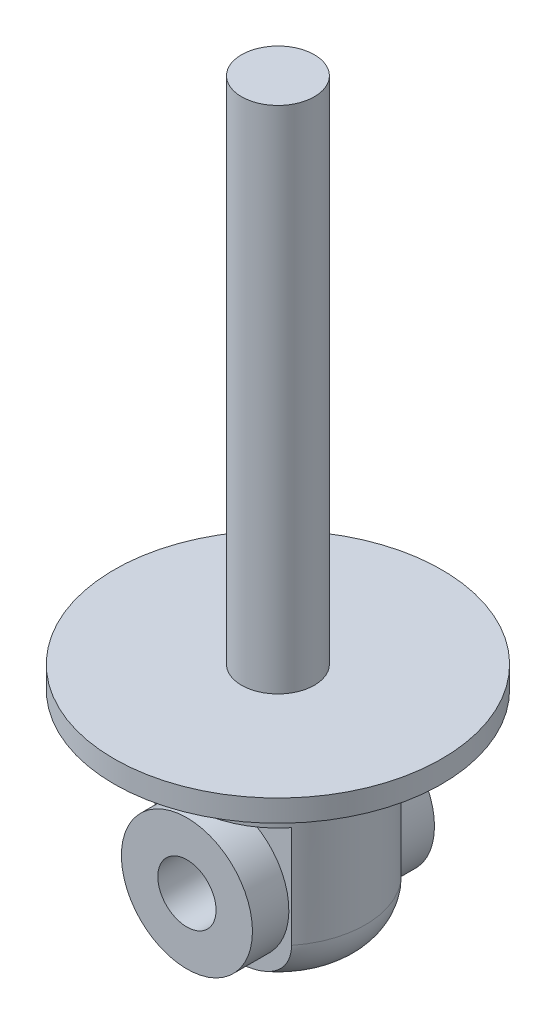
ISO-10303-21;
HEADER;
FILE_DESCRIPTION(('STEP AP214'),'2;1');
FILE_NAME('part.step','',(''),(''),'','','');
FILE_SCHEMA(('AUTOMOTIVE_DESIGN { 1 0 10303 214 1 1 1 1 }'));
ENDSEC;
DATA;
#1=APPLICATION_CONTEXT('core data for automotive mechanical design processes');
#2=APPLICATION_PROTOCOL_DEFINITION('international standard','automotive_design',2000,#1);
#3=PRODUCT_CONTEXT('',#1,'mechanical');
#4=PRODUCT('Part','Part','',(#3));
#5=PRODUCT_RELATED_PRODUCT_CATEGORY('part','',(#4));
#6=PRODUCT_DEFINITION_FORMATION('','',#4);
#7=PRODUCT_DEFINITION_CONTEXT('part definition',#1,'design');
#8=PRODUCT_DEFINITION('design','',#6,#7);
#9=PRODUCT_DEFINITION_SHAPE('','',#8);
#10=(LENGTH_UNIT() NAMED_UNIT(*) SI_UNIT(.MILLI.,.METRE.));
#11=(NAMED_UNIT(*) PLANE_ANGLE_UNIT() SI_UNIT($,.RADIAN.));
#12=(NAMED_UNIT(*) SI_UNIT($,.STERADIAN.) SOLID_ANGLE_UNIT());
#13=UNCERTAINTY_MEASURE_WITH_UNIT(LENGTH_MEASURE(1.E-05),#10,'distance_accuracy_value','');
#14=(GEOMETRIC_REPRESENTATION_CONTEXT(3) GLOBAL_UNCERTAINTY_ASSIGNED_CONTEXT((#13)) GLOBAL_UNIT_ASSIGNED_CONTEXT((#10,
#11,#12)) REPRESENTATION_CONTEXT('',''));
#15=CARTESIAN_POINT('',(0.,0.,0.));
#16=DIRECTION('',(0.,0.,1.));
#17=DIRECTION('',(1.,0.,0.));
#18=AXIS2_PLACEMENT_3D('',#15,#16,#17);
#19=CARTESIAN_POINT('',(-22.5,-8.,7.5));
#20=DIRECTION('',(0.,0.,-1.));
#21=DIRECTION('',(0.,1.,0.));
#22=AXIS2_PLACEMENT_3D('',#19,#20,#21);
#23=PLANE('',#22);
#24=CARTESIAN_POINT('',(0.,-27.8094750193111,7.5));
#25=CARTESIAN_POINT('',(0.184521628242419,-27.8094752958151,7.5));
#26=CARTESIAN_POINT('',(0.369043480287191,-27.8077270322999,7.5));
#27=CARTESIAN_POINT('',(0.737999394292284,-27.8006130628877,7.5));
#28=CARTESIAN_POINT('',(0.922433463434383,-27.7952477367066,7.5));
#29=CARTESIAN_POINT('',(1.29122559425462,-27.780538513706,7.5));
#30=CARTESIAN_POINT('',(1.47558358999919,-27.7711929215574,7.5));
#31=CARTESIAN_POINT('',(1.84401846668315,-27.7479507640883,7.5));
#32=CARTESIAN_POINT('',(2.02809534398339,-27.734054140347,7.5));
#33=CARTESIAN_POINT('',(2.39498843631837,-27.701027325669,7.5));
#34=CARTESIAN_POINT('',(2.57780665418326,-27.6819201299087,7.5));
#35=CARTESIAN_POINT('',(2.94269408038083,-27.6375682217561,7.5));
#36=CARTESIAN_POINT('',(3.12476323156505,-27.6123230495969,7.5));
#37=CARTESIAN_POINT('',(3.6691632505479,-27.5259360262262,7.5));
#38=CARTESIAN_POINT('',(4.02997739530099,-27.4541196223952,7.5));
#39=CARTESIAN_POINT('',(4.57935988961709,-27.315114172541,7.5));
#40=CARTESIAN_POINT('',(4.77122256452969,-27.2608348848703,7.5));
#41=CARTESIAN_POINT('',(5.15109529504942,-27.1402411036094,7.5));
#42=CARTESIAN_POINT('',(5.33910680786539,-27.0739312594077,7.5));
#43=CARTESIAN_POINT('',(5.70992505463463,-26.928148698992,7.5));
#44=CARTESIAN_POINT('',(5.8927332791208,-26.8486797977089,7.5));
#45=CARTESIAN_POINT('',(6.25155879665883,-26.6756224712841,7.5));
#46=CARTESIAN_POINT('',(6.42757723883459,-26.5820364486502,7.5));
#47=CARTESIAN_POINT('',(6.74413785402998,-26.3958384208508,7.5));
#48=CARTESIAN_POINT('',(6.8859302136676,-26.3053527427416,7.5));
#49=CARTESIAN_POINT('',(7.16205254122039,-26.1136422044668,7.5));
#50=CARTESIAN_POINT('',(7.29638393401337,-26.0124194056704,7.5));
#51=CARTESIAN_POINT('',(7.55627452274062,-25.7991822855038,7.5));
#52=CARTESIAN_POINT('',(7.6818315054992,-25.6871652583255,7.5));
#53=CARTESIAN_POINT('',(7.92270374400352,-25.4525813942248,7.5));
#54=CARTESIAN_POINT('',(8.03801892249803,-25.3300144777409,7.5));
#55=CARTESIAN_POINT('',(8.25792234562976,-25.0736714823962,7.5));
#56=CARTESIAN_POINT('',(8.36240569865935,-24.9398051473305,7.5));
#57=CARTESIAN_POINT('',(8.55796576900282,-24.662616920615,7.5));
#58=CARTESIAN_POINT('',(8.64904436046083,-24.5192963548439,7.5));
#59=CARTESIAN_POINT('',(8.81636481076627,-24.2243409104845,7.5));
#60=CARTESIAN_POINT('',(8.89261579636784,-24.0727112205184,7.5));
#61=CARTESIAN_POINT('',(9.02909243430965,-23.7624095052739,7.5));
#62=CARTESIAN_POINT('',(9.08932115899453,-23.6037388369551,7.5));
#63=CARTESIAN_POINT('',(9.1849514334904,-23.3052245459151,7.5));
#64=CARTESIAN_POINT('',(9.22272405795734,-23.1661361294911,7.5));
#65=CARTESIAN_POINT('',(9.28547940350164,-22.8851087613884,7.5));
#66=CARTESIAN_POINT('',(9.31046370365637,-22.7431701638949,7.5));
#67=CARTESIAN_POINT('',(9.34730641699016,-22.4576599589478,7.5));
#68=CARTESIAN_POINT('',(9.35917031033292,-22.3140890586128,7.5));
#69=CARTESIAN_POINT('',(9.36963164548865,-22.0264648581988,7.5));
#70=CARTESIAN_POINT('',(9.36822954903948,-21.8824115750842,7.5));
#71=CARTESIAN_POINT('',(9.35280339576898,-21.6061914815275,7.5));
#72=CARTESIAN_POINT('',(9.33976569953801,-21.4739684759153,7.5));
#73=CARTESIAN_POINT('',(9.30256363878721,-21.2110534946456,7.5));
#74=CARTESIAN_POINT('',(9.27839574533066,-21.0803620180608,7.5));
#75=CARTESIAN_POINT('',(9.21922065645586,-20.8215410609612,7.5));
#76=CARTESIAN_POINT('',(9.18421981495561,-20.6934101253726,7.5));
#77=CARTESIAN_POINT('',(9.1037455253616,-20.4404340442512,7.5));
#78=CARTESIAN_POINT('',(9.05826815366643,-20.3155901493276,7.5));
#79=CARTESIAN_POINT('',(8.95699564520569,-20.0692031015505,7.5));
#80=CARTESIAN_POINT('',(8.90113499399755,-19.9476868658852,7.5));
#81=CARTESIAN_POINT('',(8.77987692751896,-19.7094920695403,7.5));
#82=CARTESIAN_POINT('',(8.71447610526943,-19.5928152563103,7.5));
#83=CARTESIAN_POINT('',(8.50489875856371,-19.2509911073174,7.5));
#84=CARTESIAN_POINT('',(8.34729299116934,-19.0339195251877,7.5));
#85=CARTESIAN_POINT('',(7.98870608163152,-18.609337427954,7.5));
#86=CARTESIAN_POINT('',(7.78529755950601,-18.4039002281567,7.5));
#87=CARTESIAN_POINT('',(7.35109040646742,-18.0246758733926,7.5));
#88=CARTESIAN_POINT('',(7.12029612399674,-17.8508837047537,7.5));
#89=CARTESIAN_POINT('',(6.69864287979115,-17.5744409595824,7.5));
#90=CARTESIAN_POINT('',(6.51223410047273,-17.4648689537028,7.5));
#91=CARTESIAN_POINT('',(6.13034538679086,-17.2626904112622,7.5));
#92=CARTESIAN_POINT('',(5.93486117014358,-17.1700919878543,7.5));
#93=CARTESIAN_POINT('',(5.53658641063457,-17.0006313082269,7.5));
#94=CARTESIAN_POINT('',(5.3337765932138,-16.9238147555949,7.5));
#95=CARTESIAN_POINT('',(4.92331428460809,-16.784875362625,7.5));
#96=CARTESIAN_POINT('',(4.71566315546474,-16.7227484430634,7.5));
#97=CARTESIAN_POINT('',(4.02250667384635,-16.5386673542946,7.5));
#98=CARTESIAN_POINT('',(3.52942656369881,-16.4449803111871,7.5));
#99=CARTESIAN_POINT('',(2.78498720051466,-16.3412352530644,7.5));
#100=CARTESIAN_POINT('',(2.53568557770049,-16.3127705467372,7.5));
#101=CARTESIAN_POINT('',(2.03612434937438,-16.2658269581612,7.5));
#102=CARTESIAN_POINT('',(1.78586486368141,-16.2473468655648,7.5));
#103=CARTESIAN_POINT('',(1.28363112408652,-16.2184283009414,7.5));
#104=CARTESIAN_POINT('',(1.03165466176091,-16.208031590786,7.5));
#105=CARTESIAN_POINT('',(0.527501194688676,-16.1941849220444,7.5));
#106=CARTESIAN_POINT('',(0.275324180848907,-16.1907352988047,7.5));
#107=CARTESIAN_POINT('',(-0.22873134560298,-16.1903333462322,7.5));
#108=CARTESIAN_POINT('',(-0.480609853630178,-16.193373232494,7.5));
#109=CARTESIAN_POINT('',(-0.984173581494272,-16.2063332691715,7.5));
#110=CARTESIAN_POINT('',(-1.23585881660875,-16.2162528039696,7.5));
#111=CARTESIAN_POINT('',(-1.76278825668934,-16.2454935008677,7.5));
#112=CARTESIAN_POINT('',(-2.03798990109172,-16.2656211327378,7.5));
#113=CARTESIAN_POINT('',(-2.58731345976839,-16.3180418431017,7.5));
#114=CARTESIAN_POINT('',(-2.86143522597444,-16.3503365349836,7.5));
#115=CARTESIAN_POINT('',(-3.40623279358437,-16.4300545548583,7.5));
#116=CARTESIAN_POINT('',(-3.67691867401874,-16.4774071358833,7.5));
#117=CARTESIAN_POINT('',(-4.21439476079952,-16.5907053400646,7.5));
#118=CARTESIAN_POINT('',(-4.4811862031647,-16.6566449229111,7.5));
#119=CARTESIAN_POINT('',(-4.94217748017443,-16.7911834026755,7.5));
#120=CARTESIAN_POINT('',(-5.13778160857807,-16.8549558474619,7.5));
#121=CARTESIAN_POINT('',(-5.5239942274174,-16.9961265709521,7.5));
#122=CARTESIAN_POINT('',(-5.71460418712137,-17.0735207892669,7.5));
#123=CARTESIAN_POINT('',(-6.0892198722189,-17.2430793617625,7.5));
#124=CARTESIAN_POINT('',(-6.27322442084439,-17.3352463319138,7.5));
#125=CARTESIAN_POINT('',(-6.63256976145458,-17.5351759469553,7.5));
#126=CARTESIAN_POINT('',(-6.80791280693598,-17.6429345063483,7.5));
#127=CARTESIAN_POINT('',(-7.10989658300675,-17.8487615005737,7.5));
#128=CARTESIAN_POINT('',(-7.2387010399764,-17.9436617626469,7.5));
#129=CARTESIAN_POINT('',(-7.4885662206622,-18.143229826346,7.5));
#130=CARTESIAN_POINT('',(-7.60962602152206,-18.2478987883735,7.5));
#131=CARTESIAN_POINT('',(-7.84271387792475,-18.4668045949393,7.5));
#132=CARTESIAN_POINT('',(-7.95474473789613,-18.5810384459287,7.5));
#133=CARTESIAN_POINT('',(-8.16854933672495,-18.8187268203134,7.5));
#134=CARTESIAN_POINT('',(-8.27032449994957,-18.9421800591116,7.5));
#135=CARTESIAN_POINT('',(-8.46313596223061,-19.1987356397018,7.5));
#136=CARTESIAN_POINT('',(-8.55408255407203,-19.3319055781875,7.5));
#137=CARTESIAN_POINT('',(-8.72304401015934,-19.6061418402457,7.5));
#138=CARTESIAN_POINT('',(-8.80106500403696,-19.747204378254,7.5));
#139=CARTESIAN_POINT('',(-8.94309470867639,-20.0362068877473,7.5));
#140=CARTESIAN_POINT('',(-9.00710515749598,-20.1841460034049,7.5));
#141=CARTESIAN_POINT('',(-9.12014361193693,-20.4856380297523,7.5));
#142=CARTESIAN_POINT('',(-9.16917373274799,-20.6391901444676,7.5));
#143=CARTESIAN_POINT('',(-9.24643392787081,-20.9313639562727,7.5));
#144=CARTESIAN_POINT('',(-9.2764768563288,-21.0695088202567,7.5));
#145=CARTESIAN_POINT('',(-9.32406143536891,-21.3479315795214,7.5));
#146=CARTESIAN_POINT('',(-9.34160421520928,-21.4882092809527,7.5));
#147=CARTESIAN_POINT('',(-9.36396002322679,-21.769719609589,7.5));
#148=CARTESIAN_POINT('',(-9.36877802253041,-21.9109518422674,7.5));
#149=CARTESIAN_POINT('',(-9.36563613906261,-22.1932734390957,7.5));
#150=CARTESIAN_POINT('',(-9.35767657732182,-22.3343628067459,7.5));
#151=CARTESIAN_POINT('',(-9.32998563551062,-22.6064011749062,7.5));
#152=CARTESIAN_POINT('',(-9.31102660205279,-22.7374295539783,7.5));
#153=CARTESIAN_POINT('',(-9.26218788836622,-22.9974780227225,7.5));
#154=CARTESIAN_POINT('',(-9.23230470755187,-23.1264974548056,7.5));
#155=CARTESIAN_POINT('',(-9.16196479385525,-23.3815508516768,7.5));
#156=CARTESIAN_POINT('',(-9.12151307666088,-23.5075862018084,7.5));
#157=CARTESIAN_POINT('',(-9.03044888037393,-23.7559772755244,7.5));
#158=CARTESIAN_POINT('',(-8.97983258590813,-23.8783315975104,7.5));
#159=CARTESIAN_POINT('',(-8.86806175742509,-24.1205569584555,7.5));
#160=CARTESIAN_POINT('',(-8.8067487702029,-24.2403549182388,7.5));
#161=CARTESIAN_POINT('',(-8.67480187441993,-24.4747211723639,7.5));
#162=CARTESIAN_POINT('',(-8.60416462323316,-24.5892875713423,7.5));
#163=CARTESIAN_POINT('',(-8.37928997825773,-24.9242270275788,7.5));
#164=CARTESIAN_POINT('',(-8.21201407264851,-25.1360021075501,7.5));
#165=CARTESIAN_POINT('',(-7.83294273917799,-25.5504485361803,7.5));
#166=CARTESIAN_POINT('',(-7.61853228584699,-25.7507010772538,7.5));
#167=CARTESIAN_POINT('',(-7.16337882817297,-26.1185076671662,7.5));
#168=CARTESIAN_POINT('',(-6.92262753032978,-26.2860513710234,7.5));
#169=CARTESIAN_POINT('',(-6.47886643959529,-26.5545024709803,7.5));
#170=CARTESIAN_POINT('',(-6.27970729507799,-26.6619013252763,7.5));
#171=CARTESIAN_POINT('',(-5.87254463104012,-26.858559219587,7.5));
#172=CARTESIAN_POINT('',(-5.66453691936399,-26.9478095430478,7.5));
#173=CARTESIAN_POINT('',(-5.24180758530231,-27.1096214973705,7.5));
#174=CARTESIAN_POINT('',(-5.0270755390133,-27.1821555960046,7.5));
#175=CARTESIAN_POINT('',(-4.59305326757354,-27.3121001369762,7.5));
#176=CARTESIAN_POINT('',(-4.37376133898654,-27.3695048137837,7.5));
#177=CARTESIAN_POINT('',(-3.81417726059935,-27.4981886749365,7.5));
#178=CARTESIAN_POINT('',(-3.47183296905168,-27.5604951716191,7.5));
#179=CARTESIAN_POINT('',(-2.78359200614868,-27.6609019684328,7.5));
#180=CARTESIAN_POINT('',(-2.43769315620304,-27.6989863972919,7.5));
#181=CARTESIAN_POINT('',(-1.91723181279186,-27.7425563308733,7.5));
#182=CARTESIAN_POINT('',(-1.74318957751325,-27.7548291128016,7.5));
#183=CARTESIAN_POINT('',(-1.39487161182966,-27.7753986995787,7.5));
#184=CARTESIAN_POINT('',(-1.22059588725637,-27.7836956019396,7.5));
#185=CARTESIAN_POINT('',(-0.871965392986033,-27.796777523185,7.5));
#186=CARTESIAN_POINT('',(-0.697610658492165,-27.8015635129394,7.5));
#187=CARTESIAN_POINT('',(-0.34883735064389,-27.8079121855994,7.5));
#188=CARTESIAN_POINT('',(-0.174418775305037,-27.8094747579462,7.5));
#189=CARTESIAN_POINT('',(0.,-27.8094750193111,7.5));
#190=B_SPLINE_CURVE_WITH_KNOTS('',3,(#24,#25,#26,#27,#28,#29,#30,#31,#32,#33,#34,#35,#36,#37,
#38,#39,#40,#41,#42,#43,#44,#45,#46,#47,#48,#49,#50,#51,#52,#53,#54,#55,#56,#57,#58,#59,#60,#61,
#62,#63,#64,#65,#66,#67,#68,#69,#70,#71,#72,#73,#74,#75,#76,#77,#78,#79,#80,#81,#82,#83,#84,#85,
#86,#87,#88,#89,#90,#91,#92,#93,#94,#95,#96,#97,#98,#99,#100,#101,#102,#103,#104,#105,#106,#107,
#108,#109,#110,#111,#112,#113,#114,#115,#116,#117,#118,#119,#120,#121,#122,#123,#124,#125,#126,
#127,#128,#129,#130,#131,#132,#133,#134,#135,#136,#137,#138,#139,#140,#141,#142,#143,#144,#145,
#146,#147,#148,#149,#150,#151,#152,#153,#154,#155,#156,#157,#158,#159,#160,#161,#162,#163,#164,
#165,#166,#167,#168,#169,#170,#171,#172,#173,#174,#175,#176,#177,#178,#179,#180,#181,#182,#183,
#184,#185,#186,#187,#188,#189),.UNSPECIFIED.,.T.,.F.,(4,2,2,2,2,2,2,2,2,2,2,2,2,2,2,2,2,2,2,2,2,
2,2,2,2,2,2,2,2,2,2,2,2,2,2,2,2,2,2,2,2,2,2,2,2,2,2,2,2,2,2,2,2,2,2,2,2,2,2,2,2,2,2,2,2,2,2,2,2,
2,2,2,2,2,2,2,2,2,2,2,2,2,4),(0.,0.553556541747908,1.10705498067111,1.6607894093517,
2.21453094651203,2.76586720349669,3.31724477121585,4.41912680182766,5.01698525599297,
5.61461314908642,6.21206808675634,6.80942146164093,7.31357153503217,7.81762499361292,
8.32180513447662,8.82598907791494,9.33467160980089,9.84328295415677,10.3515802378956,
10.8597799828438,11.291588037567,11.7233427606026,12.1549170790764,12.5864763761707,
12.9845986570771,13.3828472534997,13.7808627038906,14.1790274594522,14.5797954507881,
14.9807069160888,15.7821103743006,16.6461503316802,17.5100532757815,18.1578732554314,
18.8060020817716,19.4559821948789,20.1057815998326,21.6069748462106,22.3596793389022,
23.1122925673176,23.8687687149109,24.6252813779039,25.3808870860739,26.1364251884592,
26.9640249034878,27.7917343993232,28.6156111127982,29.4392203950451,30.0559954213971,
30.6725869093733,31.2892877047367,31.9058271963483,32.3853559200308,32.86494167852,
33.3443778968313,33.823747436381,34.3068464150843,34.7897156366604,35.2725249226045,
35.7552660053908,36.1788379642465,36.6023716529343,37.0257398573389,37.4490974249689,
37.8458122806135,38.2426543730445,38.639308470493,39.0361117351623,39.4393886143668,
39.8428104576492,40.6491243408277,41.5260051520068,42.403162850804,43.08105511347,
43.7592721958253,44.4385984678268,45.1181832448309,46.1608437011148,47.2041866484774,
47.7275747628343,48.2509500399341,48.7741805338586,49.2974289735857),.UNSPECIFIED.);
#191=CARTESIAN_POINT('',(-9.3674969975976,-22.,7.5));
#192=VERTEX_POINT('',#191);
#193=CARTESIAN_POINT('',(9.36749699759766,-21.9999999999999,7.5));
#194=VERTEX_POINT('',#193);
#195=EDGE_CURVE('E146',#192,#194,#190,.T.);
#196=ORIENTED_EDGE('',*,*,#195,.T.);
#197=DIRECTION('',(0.,1.,0.));
#198=VECTOR('',#197,1.);
#199=CARTESIAN_POINT('',(9.3674969975976,-28.,7.49999999999999));
#200=LINE('',#199,#198);
#201=CARTESIAN_POINT('',(9.36749699759759,-8.,7.5));
#202=VERTEX_POINT('',#201);
#203=EDGE_CURVE('E97',#202,#194,#200,.F.);
#204=ORIENTED_EDGE('',*,*,#203,.F.);
#205=DIRECTION('',(1.,0.,0.));
#206=VECTOR('',#205,1.);
#207=CARTESIAN_POINT('',(-22.5,-8.,7.5));
#208=LINE('',#207,#206);
#209=CARTESIAN_POINT('',(-9.36749699759761,-8.,7.5));
#210=VERTEX_POINT('',#209);
#211=EDGE_CURVE('E89',#210,#202,#208,.T.);
#212=ORIENTED_EDGE('',*,*,#211,.F.);
#213=DIRECTION('',(0.,1.,0.));
#214=VECTOR('',#213,1.);
#215=CARTESIAN_POINT('',(-9.3674969975976,-28.,7.49999999999999));
#216=LINE('',#215,#214);
#217=EDGE_CURVE('E67',#192,#210,#216,.T.);
#218=ORIENTED_EDGE('',*,*,#217,.F.);
#219=EDGE_LOOP('',(#196,#204,#212,#218));
#220=FACE_BOUND('',#219,.T.);
#221=CARTESIAN_POINT('',(0.,-18.,7.5));
#222=DIRECTION('',(0.,0.,-1.));
#223=DIRECTION('',(0.,1.,0.));
#224=AXIS2_PLACEMENT_3D('',#221,#222,#223);
#225=CIRCLE('',#224,9.);
#226=CARTESIAN_POINT('',(0.,-9.,7.5));
#227=VERTEX_POINT('',#226);
#228=EDGE_CURVE('E11',#227,#227,#225,.F.);
#229=ORIENTED_EDGE('',*,*,#228,.F.);
#230=EDGE_LOOP('',(#229));
#231=FACE_BOUND('',#230,.T.);
#232=ADVANCED_FACE('F41',(#220,#231),#23,.F.);
#233=CARTESIAN_POINT('',(-22.5,-8.,-7.5));
#234=DIRECTION('',(0.,0.,1.));
#235=DIRECTION('',(0.,-1.,0.));
#236=AXIS2_PLACEMENT_3D('',#233,#234,#235);
#237=PLANE('',#236);
#238=CARTESIAN_POINT('',(0.,-27.8094750193111,-7.5));
#239=CARTESIAN_POINT('',(-0.18452162824242,-27.8094752958151,-7.5));
#240=CARTESIAN_POINT('',(-0.369043480287192,-27.8077270322999,-7.5));
#241=CARTESIAN_POINT('',(-0.737999394292285,-27.8006130628877,-7.5));
#242=CARTESIAN_POINT('',(-0.922433463434385,-27.7952477367066,-7.5));
#243=CARTESIAN_POINT('',(-1.29122559425462,-27.780538513706,-7.5));
#244=CARTESIAN_POINT('',(-1.47558358999919,-27.7711929215574,-7.5));
#245=CARTESIAN_POINT('',(-1.84401846668315,-27.7479507640883,-7.5));
#246=CARTESIAN_POINT('',(-2.02809534398339,-27.734054140347,-7.5));
#247=CARTESIAN_POINT('',(-2.39498843631837,-27.701027325669,-7.5));
#248=CARTESIAN_POINT('',(-2.57780665418326,-27.6819201299087,-7.5));
#249=CARTESIAN_POINT('',(-2.94269408038083,-27.6375682217561,-7.5));
#250=CARTESIAN_POINT('',(-3.12476323156505,-27.6123230495969,-7.5));
#251=CARTESIAN_POINT('',(-3.6691632505479,-27.5259360262262,-7.5));
#252=CARTESIAN_POINT('',(-4.02997739530099,-27.4541196223952,-7.5));
#253=CARTESIAN_POINT('',(-4.57935988961709,-27.315114172541,-7.5));
#254=CARTESIAN_POINT('',(-4.77122256452969,-27.2608348848703,-7.5));
#255=CARTESIAN_POINT('',(-5.15109529504943,-27.1402411036094,-7.5));
#256=CARTESIAN_POINT('',(-5.33910680786539,-27.0739312594077,-7.5));
#257=CARTESIAN_POINT('',(-5.70992505463463,-26.9281486989919,-7.5));
#258=CARTESIAN_POINT('',(-5.8927332791208,-26.8486797977089,-7.5));
#259=CARTESIAN_POINT('',(-6.25155879665883,-26.6756224712841,-7.5));
#260=CARTESIAN_POINT('',(-6.42757723883459,-26.5820364486501,-7.5));
#261=CARTESIAN_POINT('',(-6.74413785402998,-26.3958384208508,-7.5));
#262=CARTESIAN_POINT('',(-6.8859302136676,-26.3053527427416,-7.5));
#263=CARTESIAN_POINT('',(-7.16205254122039,-26.1136422044668,-7.5));
#264=CARTESIAN_POINT('',(-7.29638393401337,-26.0124194056704,-7.5));
#265=CARTESIAN_POINT('',(-7.55627452274062,-25.7991822855038,-7.5));
#266=CARTESIAN_POINT('',(-7.6818315054992,-25.6871652583255,-7.5));
#267=CARTESIAN_POINT('',(-7.92270374400352,-25.4525813942248,-7.5));
#268=CARTESIAN_POINT('',(-8.03801892249803,-25.3300144777409,-7.5));
#269=CARTESIAN_POINT('',(-8.25792234562975,-25.0736714823962,-7.5));
#270=CARTESIAN_POINT('',(-8.36240569865935,-24.9398051473305,-7.5));
#271=CARTESIAN_POINT('',(-8.55796576900282,-24.662616920615,-7.5));
#272=CARTESIAN_POINT('',(-8.64904436046083,-24.5192963548439,-7.5));
#273=CARTESIAN_POINT('',(-8.81636481076626,-24.2243409104845,-7.5));
#274=CARTESIAN_POINT('',(-8.89261579636783,-24.0727112205184,-7.5));
#275=CARTESIAN_POINT('',(-9.02909243430965,-23.7624095052739,-7.5));
#276=CARTESIAN_POINT('',(-9.08932115899453,-23.6037388369551,-7.5));
#277=CARTESIAN_POINT('',(-9.1849514334904,-23.3052245459151,-7.5));
#278=CARTESIAN_POINT('',(-9.22272405795733,-23.166136129491,-7.5));
#279=CARTESIAN_POINT('',(-9.28547940350163,-22.8851087613884,-7.5));
#280=CARTESIAN_POINT('',(-9.31046370365637,-22.7431701638949,-7.5));
#281=CARTESIAN_POINT('',(-9.34730641699015,-22.4576599589478,-7.5));
#282=CARTESIAN_POINT('',(-9.35917031033292,-22.3140890586128,-7.5));
#283=CARTESIAN_POINT('',(-9.36963164548865,-22.0264648581988,-7.5));
#284=CARTESIAN_POINT('',(-9.36822954903947,-21.8824115750842,-7.5));
#285=CARTESIAN_POINT('',(-9.35280339576898,-21.6061914815275,-7.5));
#286=CARTESIAN_POINT('',(-9.33976569953801,-21.4739684759153,-7.5));
#287=CARTESIAN_POINT('',(-9.3025636387872,-21.2110534946456,-7.5));
#288=CARTESIAN_POINT('',(-9.27839574533065,-21.0803620180608,-7.5));
#289=CARTESIAN_POINT('',(-9.21922065645586,-20.8215410609612,-7.5));
#290=CARTESIAN_POINT('',(-9.1842198149556,-20.6934101253726,-7.5));
#291=CARTESIAN_POINT('',(-9.1037455253616,-20.4404340442512,-7.5));
#292=CARTESIAN_POINT('',(-9.05826815366643,-20.3155901493276,-7.5));
#293=CARTESIAN_POINT('',(-8.95699564520569,-20.0692031015505,-7.5));
#294=CARTESIAN_POINT('',(-8.90113499399755,-19.9476868658852,-7.5));
#295=CARTESIAN_POINT('',(-8.77987692751896,-19.7094920695403,-7.5));
#296=CARTESIAN_POINT('',(-8.71447610526942,-19.5928152563103,-7.5));
#297=CARTESIAN_POINT('',(-8.50489875856371,-19.2509911073174,-7.5));
#298=CARTESIAN_POINT('',(-8.34729299116934,-19.0339195251877,-7.5));
#299=CARTESIAN_POINT('',(-7.98870608163152,-18.609337427954,-7.5));
#300=CARTESIAN_POINT('',(-7.78529755950601,-18.4039002281567,-7.5));
#301=CARTESIAN_POINT('',(-7.35109040646742,-18.0246758733926,-7.5));
#302=CARTESIAN_POINT('',(-7.12029612399674,-17.8508837047537,-7.5));
#303=CARTESIAN_POINT('',(-6.69864287979115,-17.5744409595824,-7.5));
#304=CARTESIAN_POINT('',(-6.51223410047273,-17.4648689537028,-7.5));
#305=CARTESIAN_POINT('',(-6.13034538679086,-17.2626904112623,-7.5));
#306=CARTESIAN_POINT('',(-5.93486117014358,-17.1700919878543,-7.5));
#307=CARTESIAN_POINT('',(-5.53658641063457,-17.0006313082269,-7.5));
#308=CARTESIAN_POINT('',(-5.3337765932138,-16.9238147555949,-7.5));
#309=CARTESIAN_POINT('',(-4.9233142846081,-16.784875362625,-7.5));
#310=CARTESIAN_POINT('',(-4.71566315546474,-16.7227484430634,-7.5));
#311=CARTESIAN_POINT('',(-4.02250667384635,-16.5386673542946,-7.5));
#312=CARTESIAN_POINT('',(-3.52942656369881,-16.4449803111871,-7.5));
#313=CARTESIAN_POINT('',(-2.78498720051466,-16.3412352530644,-7.5));
#314=CARTESIAN_POINT('',(-2.53568557770049,-16.3127705467372,-7.5));
#315=CARTESIAN_POINT('',(-2.03612434937438,-16.2658269581612,-7.5));
#316=CARTESIAN_POINT('',(-1.78586486368141,-16.2473468655649,-7.5));
#317=CARTESIAN_POINT('',(-1.28363112408652,-16.2184283009414,-7.5));
#318=CARTESIAN_POINT('',(-1.03165466176091,-16.208031590786,-7.5));
#319=CARTESIAN_POINT('',(-0.527501194688677,-16.1941849220444,-7.5));
#320=CARTESIAN_POINT('',(-0.275324180848908,-16.1907352988047,-7.5));
#321=CARTESIAN_POINT('',(0.22873134560298,-16.1903333462322,-7.5));
#322=CARTESIAN_POINT('',(0.480609853630179,-16.193373232494,-7.5));
#323=CARTESIAN_POINT('',(0.984173581494273,-16.2063332691715,-7.5));
#324=CARTESIAN_POINT('',(1.23585881660875,-16.2162528039696,-7.5));
#325=CARTESIAN_POINT('',(1.76278825668934,-16.2454935008677,-7.5));
#326=CARTESIAN_POINT('',(2.03798990109172,-16.2656211327378,-7.5));
#327=CARTESIAN_POINT('',(2.58731345976839,-16.3180418431018,-7.5));
#328=CARTESIAN_POINT('',(2.86143522597444,-16.3503365349836,-7.5));
#329=CARTESIAN_POINT('',(3.40623279358437,-16.4300545548583,-7.5));
#330=CARTESIAN_POINT('',(3.67691867401874,-16.4774071358833,-7.5));
#331=CARTESIAN_POINT('',(4.21439476079952,-16.5907053400646,-7.5));
#332=CARTESIAN_POINT('',(4.4811862031647,-16.6566449229111,-7.5));
#333=CARTESIAN_POINT('',(4.94217748017443,-16.7911834026755,-7.5));
#334=CARTESIAN_POINT('',(5.13778160857807,-16.8549558474619,-7.5));
#335=CARTESIAN_POINT('',(5.5239942274174,-16.9961265709521,-7.5));
#336=CARTESIAN_POINT('',(5.71460418712137,-17.073520789267,-7.5));
#337=CARTESIAN_POINT('',(6.0892198722189,-17.2430793617625,-7.5));
#338=CARTESIAN_POINT('',(6.27322442084439,-17.3352463319138,-7.5));
#339=CARTESIAN_POINT('',(6.63256976145458,-17.5351759469553,-7.5));
#340=CARTESIAN_POINT('',(6.80791280693598,-17.6429345063483,-7.5));
#341=CARTESIAN_POINT('',(7.10989658300674,-17.8487615005737,-7.5));
#342=CARTESIAN_POINT('',(7.2387010399764,-17.9436617626469,-7.5));
#343=CARTESIAN_POINT('',(7.48856622066219,-18.143229826346,-7.5));
#344=CARTESIAN_POINT('',(7.60962602152205,-18.2478987883735,-7.5));
#345=CARTESIAN_POINT('',(7.84271387792474,-18.4668045949393,-7.5));
#346=CARTESIAN_POINT('',(7.95474473789612,-18.5810384459287,-7.5));
#347=CARTESIAN_POINT('',(8.16854933672494,-18.8187268203134,-7.5));
#348=CARTESIAN_POINT('',(8.27032449994957,-18.9421800591116,-7.5));
#349=CARTESIAN_POINT('',(8.46313596223061,-19.1987356397018,-7.5));
#350=CARTESIAN_POINT('',(8.55408255407203,-19.3319055781875,-7.5));
#351=CARTESIAN_POINT('',(8.72304401015934,-19.6061418402457,-7.5));
#352=CARTESIAN_POINT('',(8.80106500403696,-19.747204378254,-7.5));
#353=CARTESIAN_POINT('',(8.94309470867639,-20.0362068877473,-7.5));
#354=CARTESIAN_POINT('',(9.00710515749598,-20.1841460034049,-7.5));
#355=CARTESIAN_POINT('',(9.12014361193693,-20.4856380297523,-7.5));
#356=CARTESIAN_POINT('',(9.16917373274798,-20.6391901444676,-7.5));
#357=CARTESIAN_POINT('',(9.24643392787081,-20.9313639562727,-7.5));
#358=CARTESIAN_POINT('',(9.27647685632879,-21.0695088202567,-7.5));
#359=CARTESIAN_POINT('',(9.32406143536891,-21.3479315795213,-7.5));
#360=CARTESIAN_POINT('',(9.34160421520928,-21.4882092809526,-7.5));
#361=CARTESIAN_POINT('',(9.36396002322678,-21.769719609589,-7.5));
#362=CARTESIAN_POINT('',(9.36877802253041,-21.9109518422674,-7.5));
#363=CARTESIAN_POINT('',(9.36563613906261,-22.1932734390957,-7.5));
#364=CARTESIAN_POINT('',(9.35767657732181,-22.3343628067459,-7.5));
#365=CARTESIAN_POINT('',(9.32998563551062,-22.6064011749062,-7.5));
#366=CARTESIAN_POINT('',(9.31102660205278,-22.7374295539783,-7.5));
#367=CARTESIAN_POINT('',(9.26218788836622,-22.9974780227225,-7.5));
#368=CARTESIAN_POINT('',(9.23230470755187,-23.1264974548056,-7.5));
#369=CARTESIAN_POINT('',(9.16196479385525,-23.3815508516768,-7.5));
#370=CARTESIAN_POINT('',(9.12151307666088,-23.5075862018083,-7.5));
#371=CARTESIAN_POINT('',(9.03044888037393,-23.7559772755244,-7.5));
#372=CARTESIAN_POINT('',(8.97983258590813,-23.8783315975104,-7.5));
#373=CARTESIAN_POINT('',(8.86806175742509,-24.1205569584555,-7.5));
#374=CARTESIAN_POINT('',(8.8067487702029,-24.2403549182387,-7.5));
#375=CARTESIAN_POINT('',(8.67480187441992,-24.4747211723639,-7.5));
#376=CARTESIAN_POINT('',(8.60416462323316,-24.5892875713423,-7.5));
#377=CARTESIAN_POINT('',(8.37928997825773,-24.9242270275788,-7.5));
#378=CARTESIAN_POINT('',(8.21201407264851,-25.13600210755,-7.5));
#379=CARTESIAN_POINT('',(7.832942739178,-25.5504485361803,-7.5));
#380=CARTESIAN_POINT('',(7.61853228584699,-25.7507010772538,-7.5));
#381=CARTESIAN_POINT('',(7.16337882817298,-26.1185076671662,-7.5));
#382=CARTESIAN_POINT('',(6.92262753032979,-26.2860513710234,-7.5));
#383=CARTESIAN_POINT('',(6.4788664395953,-26.5545024709803,-7.5));
#384=CARTESIAN_POINT('',(6.27970729507799,-26.6619013252763,-7.5));
#385=CARTESIAN_POINT('',(5.87254463104012,-26.858559219587,-7.5));
#386=CARTESIAN_POINT('',(5.664536919364,-26.9478095430477,-7.5));
#387=CARTESIAN_POINT('',(5.24180758530232,-27.1096214973705,-7.5));
#388=CARTESIAN_POINT('',(5.02707553901331,-27.1821555960046,-7.5));
#389=CARTESIAN_POINT('',(4.59305326757355,-27.3121001369762,-7.5));
#390=CARTESIAN_POINT('',(4.37376133898656,-27.3695048137837,-7.5));
#391=CARTESIAN_POINT('',(3.81417726059936,-27.4981886749365,-7.5));
#392=CARTESIAN_POINT('',(3.47183296905169,-27.5604951716191,-7.5));
#393=CARTESIAN_POINT('',(2.78359200614869,-27.6609019684328,-7.5));
#394=CARTESIAN_POINT('',(2.43769315620305,-27.6989863972919,-7.5));
#395=CARTESIAN_POINT('',(1.91723181279187,-27.7425563308733,-7.5));
#396=CARTESIAN_POINT('',(1.74318957751326,-27.7548291128016,-7.5));
#397=CARTESIAN_POINT('',(1.39487161182967,-27.7753986995787,-7.5));
#398=CARTESIAN_POINT('',(1.22059588725638,-27.7836956019396,-7.5));
#399=CARTESIAN_POINT('',(0.871965392986034,-27.796777523185,-7.5));
#400=CARTESIAN_POINT('',(0.697610658492164,-27.8015635129394,-7.5));
#401=CARTESIAN_POINT('',(0.348837350643889,-27.8079121855994,-7.5));
#402=CARTESIAN_POINT('',(0.174418775305036,-27.8094747579462,-7.5));
#403=CARTESIAN_POINT('',(0.,-27.8094750193111,-7.5));
#404=B_SPLINE_CURVE_WITH_KNOTS('',3,(#238,#239,#240,#241,#242,#243,#244,#245,#246,#247,#248,
#249,#250,#251,#252,#253,#254,#255,#256,#257,#258,#259,#260,#261,#262,#263,#264,#265,#266,#267,
#268,#269,#270,#271,#272,#273,#274,#275,#276,#277,#278,#279,#280,#281,#282,#283,#284,#285,#286,
#287,#288,#289,#290,#291,#292,#293,#294,#295,#296,#297,#298,#299,#300,#301,#302,#303,#304,#305,
#306,#307,#308,#309,#310,#311,#312,#313,#314,#315,#316,#317,#318,#319,#320,#321,#322,#323,#324,
#325,#326,#327,#328,#329,#330,#331,#332,#333,#334,#335,#336,#337,#338,#339,#340,#341,#342,#343,
#344,#345,#346,#347,#348,#349,#350,#351,#352,#353,#354,#355,#356,#357,#358,#359,#360,#361,#362,
#363,#364,#365,#366,#367,#368,#369,#370,#371,#372,#373,#374,#375,#376,#377,#378,#379,#380,#381,
#382,#383,#384,#385,#386,#387,#388,#389,#390,#391,#392,#393,#394,#395,#396,#397,#398,#399,#400,
#401,#402,#403),.UNSPECIFIED.,.T.,.F.,(4,2,2,2,2,2,2,2,2,2,2,2,2,2,2,2,2,2,2,2,2,2,2,2,2,2,2,2,
2,2,2,2,2,2,2,2,2,2,2,2,2,2,2,2,2,2,2,2,2,2,2,2,2,2,2,2,2,2,2,2,2,2,2,2,2,2,2,2,2,2,2,2,2,2,2,2,
2,2,2,2,2,2,4),(0.,0.553556541747908,1.10705498067111,1.66078940935171,2.21453094651203,
2.7658672034967,3.31724477121585,4.41912680182767,5.01698525599297,5.61461314908642,
6.21206808675634,6.80942146164093,7.31357153503217,7.81762499361292,8.32180513447662,
8.82598907791494,9.33467160980089,9.84328295415676,10.3515802378956,10.8597799828438,
11.291588037567,11.7233427606026,12.1549170790764,12.5864763761707,12.9845986570771,
13.3828472534997,13.7808627038906,14.1790274594522,14.579795450788,14.9807069160888,
15.7821103743006,16.6461503316802,17.5100532757815,18.1578732554314,18.8060020817716,
19.4559821948789,20.1057815998326,21.6069748462106,22.3596793389022,23.1122925673176,
23.8687687149109,24.6252813779039,25.3808870860739,26.1364251884592,26.9640249034878,
27.7917343993232,28.6156111127982,29.4392203950451,30.0559954213971,30.6725869093733,
31.2892877047367,31.9058271963483,32.3853559200308,32.8649416785199,33.3443778968313,
33.823747436381,34.3068464150843,34.7897156366603,35.2725249226045,35.7552660053908,
36.1788379642465,36.6023716529342,37.0257398573389,37.4490974249689,37.8458122806135,
38.2426543730445,38.6393084704929,39.0361117351622,39.4393886143668,39.8428104576491,
40.6491243408277,41.5260051520067,42.4031628508039,43.0810551134699,43.7592721958252,
44.4385984678267,45.1181832448308,46.1608437011148,47.2041866484774,47.7275747628343,
48.2509500399341,48.7741805338585,49.2974289735857),.UNSPECIFIED.);
#405=CARTESIAN_POINT('',(9.3674969975976,-22.,-7.5));
#406=VERTEX_POINT('',#405);
#407=CARTESIAN_POINT('',(-9.36749699759765,-21.9999999999999,-7.5));
#408=VERTEX_POINT('',#407);
#409=EDGE_CURVE('E94',#406,#408,#404,.T.);
#410=ORIENTED_EDGE('',*,*,#409,.T.);
#411=DIRECTION('',(0.,1.,0.));
#412=VECTOR('',#411,1.);
#413=CARTESIAN_POINT('',(-9.3674969975976,-28.,-7.5));
#414=LINE('',#413,#412);
#415=CARTESIAN_POINT('',(-9.3674969975976,-8.,-7.5));
#416=VERTEX_POINT('',#415);
#417=EDGE_CURVE('E110',#416,#408,#414,.F.);
#418=ORIENTED_EDGE('',*,*,#417,.F.);
#419=DIRECTION('',(1.,0.,0.));
#420=VECTOR('',#419,1.);
#421=CARTESIAN_POINT('',(-22.5,-8.,-7.5));
#422=LINE('',#421,#420);
#423=CARTESIAN_POINT('',(9.3674969975976,-8.,-7.5));
#424=VERTEX_POINT('',#423);
#425=EDGE_CURVE('E99',#416,#424,#422,.T.);
#426=ORIENTED_EDGE('',*,*,#425,.T.);
#427=DIRECTION('',(0.,1.,0.));
#428=VECTOR('',#427,1.);
#429=CARTESIAN_POINT('',(9.3674969975976,-28.,-7.5));
#430=LINE('',#429,#428);
#431=EDGE_CURVE('E59',#406,#424,#430,.T.);
#432=ORIENTED_EDGE('',*,*,#431,.F.);
#433=EDGE_LOOP('',(#410,#418,#426,#432));
#434=FACE_BOUND('',#433,.T.);
#435=CARTESIAN_POINT('',(0.,-18.,-7.5));
#436=DIRECTION('',(0.,0.,1.));
#437=DIRECTION('',(0.,-1.,0.));
#438=AXIS2_PLACEMENT_3D('',#435,#436,#437);
#439=CIRCLE('',#438,9.);
#440=CARTESIAN_POINT('',(0.,-27.,-7.50000000000001));
#441=VERTEX_POINT('',#440);
#442=EDGE_CURVE('E46',#441,#441,#439,.F.);
#443=ORIENTED_EDGE('',*,*,#442,.F.);
#444=EDGE_LOOP('',(#443));
#445=FACE_BOUND('',#444,.T.);
#446=ADVANCED_FACE('F161',(#434,#445),#237,.F.);
#447=CARTESIAN_POINT('',(0.,3.,0.));
#448=DIRECTION('',(0.,-1.,0.));
#449=DIRECTION('',(0.,0.,-1.));
#450=AXIS2_PLACEMENT_3D('',#447,#448,#449);
#451=CYLINDRICAL_SURFACE('',#450,22.5);
#452=CARTESIAN_POINT('',(0.,3.,0.));
#453=DIRECTION('',(0.,1.,0.));
#454=DIRECTION('',(0.,0.,1.));
#455=AXIS2_PLACEMENT_3D('',#452,#453,#454);
#456=CIRCLE('',#455,22.5);
#457=CARTESIAN_POINT('',(0.,3.,22.5));
#458=VERTEX_POINT('',#457);
#459=EDGE_CURVE('E133',#458,#458,#456,.T.);
#460=ORIENTED_EDGE('',*,*,#459,.F.);
#461=EDGE_LOOP('',(#460));
#462=FACE_BOUND('',#461,.T.);
#463=CARTESIAN_POINT('',(0.,0.,0.));
#464=DIRECTION('',(0.,1.,0.));
#465=DIRECTION('',(0.,0.,1.));
#466=AXIS2_PLACEMENT_3D('',#463,#464,#465);
#467=CIRCLE('',#466,22.5);
#468=CARTESIAN_POINT('',(0.,0.,22.5));
#469=VERTEX_POINT('',#468);
#470=EDGE_CURVE('E129',#469,#469,#467,.T.);
#471=ORIENTED_EDGE('',*,*,#470,.T.);
#472=EDGE_LOOP('',(#471));
#473=FACE_BOUND('',#472,.T.);
#474=ADVANCED_FACE('F183',(#462,#473),#451,.T.);
#475=CARTESIAN_POINT('',(0.,3.,0.));
#476=DIRECTION('',(0.,1.,0.));
#477=DIRECTION('',(0.,0.,1.));
#478=AXIS2_PLACEMENT_3D('',#475,#476,#477);
#479=PLANE('',#478);
#480=CARTESIAN_POINT('',(0.,3.,0.));
#481=DIRECTION('',(0.,1.,0.));
#482=DIRECTION('',(0.,0.,1.));
#483=AXIS2_PLACEMENT_3D('',#480,#481,#482);
#484=CIRCLE('',#483,5.);
#485=CARTESIAN_POINT('',(0.,3.,5.));
#486=VERTEX_POINT('',#485);
#487=EDGE_CURVE('E125',#486,#486,#484,.T.);
#488=ORIENTED_EDGE('',*,*,#487,.F.);
#489=EDGE_LOOP('',(#488));
#490=FACE_BOUND('',#489,.T.);
#491=ORIENTED_EDGE('',*,*,#459,.T.);
#492=EDGE_LOOP('',(#491));
#493=FACE_BOUND('',#492,.T.);
#494=ADVANCED_FACE('F180',(#490,#493),#479,.T.);
#495=CARTESIAN_POINT('',(0.,0.,0.));
#496=DIRECTION('',(0.,1.,0.));
#497=DIRECTION('',(0.,0.,1.));
#498=AXIS2_PLACEMENT_3D('',#495,#496,#497);
#499=PLANE('',#498);
#500=CARTESIAN_POINT('',(0.,0.,0.));
#501=DIRECTION('',(0.,-1.,0.));
#502=DIRECTION('',(0.,0.,-1.));
#503=AXIS2_PLACEMENT_3D('',#500,#501,#502);
#504=CIRCLE('',#503,12.);
#505=CARTESIAN_POINT('',(0.,0.,-12.));
#506=VERTEX_POINT('',#505);
#507=EDGE_CURVE('E120',#506,#506,#504,.T.);
#508=ORIENTED_EDGE('',*,*,#507,.F.);
#509=EDGE_LOOP('',(#508));
#510=FACE_BOUND('',#509,.T.);
#511=ORIENTED_EDGE('',*,*,#470,.F.);
#512=EDGE_LOOP('',(#511));
#513=FACE_BOUND('',#512,.T.);
#514=ADVANCED_FACE('F178',(#510,#513),#499,.F.);
#515=CARTESIAN_POINT('',(0.,73.,0.));
#516=DIRECTION('',(0.,-1.,0.));
#517=DIRECTION('',(0.,0.,-1.));
#518=AXIS2_PLACEMENT_3D('',#515,#516,#517);
#519=CYLINDRICAL_SURFACE('',#518,5.);
#520=CARTESIAN_POINT('',(0.,73.,0.));
#521=DIRECTION('',(0.,1.,0.));
#522=DIRECTION('',(0.,0.,1.));
#523=AXIS2_PLACEMENT_3D('',#520,#521,#522);
#524=CIRCLE('',#523,5.);
#525=CARTESIAN_POINT('',(0.,73.,5.));
#526=VERTEX_POINT('',#525);
#527=EDGE_CURVE('E119',#526,#526,#524,.T.);
#528=ORIENTED_EDGE('',*,*,#527,.F.);
#529=EDGE_LOOP('',(#528));
#530=FACE_BOUND('',#529,.T.);
#531=ORIENTED_EDGE('',*,*,#487,.T.);
#532=EDGE_LOOP('',(#531));
#533=FACE_BOUND('',#532,.T.);
#534=ADVANCED_FACE('F174',(#530,#533),#519,.T.);
#535=CARTESIAN_POINT('',(0.,73.,0.));
#536=DIRECTION('',(0.,1.,0.));
#537=DIRECTION('',(0.,0.,1.));
#538=AXIS2_PLACEMENT_3D('',#535,#536,#537);
#539=PLANE('',#538);
#540=ORIENTED_EDGE('',*,*,#527,.T.);
#541=EDGE_LOOP('',(#540));
#542=FACE_BOUND('',#541,.T.);
#543=ADVANCED_FACE('F171',(#542),#539,.T.);
#544=CARTESIAN_POINT('',(0.,-28.,0.));
#545=DIRECTION('',(0.,1.,0.));
#546=DIRECTION('',(0.,0.,1.));
#547=AXIS2_PLACEMENT_3D('',#544,#545,#546);
#548=CYLINDRICAL_SURFACE('',#547,12.);
#549=CARTESIAN_POINT('',(0.,-22.,0.));
#550=DIRECTION('',(0.,-1.,0.));
#551=DIRECTION('',(0.,0.,-1.));
#552=AXIS2_PLACEMENT_3D('',#549,#550,#551);
#553=CIRCLE('',#552,12.);
#554=EDGE_CURVE('E143',#194,#406,#553,.F.);
#555=ORIENTED_EDGE('',*,*,#554,.T.);
#556=ORIENTED_EDGE('',*,*,#431,.T.);
#557=CARTESIAN_POINT('',(0.,-8.,0.));
#558=DIRECTION('',(0.,1.,0.));
#559=DIRECTION('',(0.,0.,1.));
#560=AXIS2_PLACEMENT_3D('',#557,#558,#559);
#561=CIRCLE('',#560,12.);
#562=EDGE_CURVE('E93',#424,#416,#561,.T.);
#563=ORIENTED_EDGE('',*,*,#562,.T.);
#564=ORIENTED_EDGE('',*,*,#417,.T.);
#565=EDGE_CURVE('E108',#408,#192,#553,.F.);
#566=ORIENTED_EDGE('',*,*,#565,.T.);
#567=ORIENTED_EDGE('',*,*,#217,.T.);
#568=CARTESIAN_POINT('',(0.,-8.,0.));
#569=DIRECTION('',(0.,1.,0.));
#570=DIRECTION('',(0.,0.,1.));
#571=AXIS2_PLACEMENT_3D('',#568,#569,#570);
#572=CIRCLE('',#571,12.);
#573=EDGE_CURVE('E87',#210,#202,#572,.T.);
#574=ORIENTED_EDGE('',*,*,#573,.T.);
#575=ORIENTED_EDGE('',*,*,#203,.T.);
#576=EDGE_LOOP('',(#555,#556,#563,#564,#566,#567,#574,#575));
#577=FACE_BOUND('',#576,.T.);
#578=ORIENTED_EDGE('',*,*,#507,.T.);
#579=EDGE_LOOP('',(#578));
#580=FACE_BOUND('',#579,.T.);
#581=ADVANCED_FACE('F104',(#577,#580),#548,.T.);
#582=CARTESIAN_POINT('',(0.,-28.,0.));
#583=DIRECTION('',(0.,-1.,0.));
#584=DIRECTION('',(0.,0.,-1.));
#585=AXIS2_PLACEMENT_3D('',#582,#583,#584);
#586=PLANE('',#585);
#587=CARTESIAN_POINT('',(0.,-28.,0.));
#588=DIRECTION('',(0.,-1.,0.));
#589=DIRECTION('',(0.,0.,-1.));
#590=AXIS2_PLACEMENT_3D('',#587,#588,#589);
#591=CIRCLE('',#590,6.);
#592=CARTESIAN_POINT('',(0.,-28.,-6.));
#593=VERTEX_POINT('',#592);
#594=EDGE_CURVE('E124',#593,#593,#591,.T.);
#595=ORIENTED_EDGE('',*,*,#594,.T.);
#596=EDGE_LOOP('',(#595));
#597=FACE_BOUND('',#596,.T.);
#598=ADVANCED_FACE('F165',(#597),#586,.T.);
#599=CARTESIAN_POINT('',(0.,-22.,0.));
#600=DIRECTION('',(0.,-1.,0.));
#601=DIRECTION('',(0.,0.,-1.));
#602=AXIS2_PLACEMENT_3D('',#599,#600,#601);
#603=TOROIDAL_SURFACE('',#602,6.,6.);
#604=ORIENTED_EDGE('',*,*,#409,.F.);
#605=ORIENTED_EDGE('',*,*,#554,.F.);
#606=ORIENTED_EDGE('',*,*,#195,.F.);
#607=ORIENTED_EDGE('',*,*,#565,.F.);
#608=EDGE_LOOP('',(#604,#605,#606,#607));
#609=FACE_BOUND('',#608,.T.);
#610=ORIENTED_EDGE('',*,*,#594,.F.);
#611=EDGE_LOOP('',(#610));
#612=FACE_BOUND('',#611,.T.);
#613=ADVANCED_FACE('F43',(#609,#612),#603,.T.);
#614=CARTESIAN_POINT('',(-22.5,-8.00000000000001,21.4099856929679));
#615=DIRECTION('',(0.,1.,0.));
#616=DIRECTION('',(0.,0.,1.));
#617=AXIS2_PLACEMENT_3D('',#614,#615,#616);
#618=PLANE('',#617);
#619=ORIENTED_EDGE('',*,*,#211,.T.);
#620=ORIENTED_EDGE('',*,*,#573,.F.);
#621=EDGE_LOOP('',(#619,#620));
#622=FACE_BOUND('',#621,.T.);
#623=ADVANCED_FACE('F88',(#622),#618,.F.);
#624=CARTESIAN_POINT('',(-22.5,-8.,-21.4099856929679));
#625=DIRECTION('',(0.,1.,0.));
#626=DIRECTION('',(0.,0.,1.));
#627=AXIS2_PLACEMENT_3D('',#624,#625,#626);
#628=PLANE('',#627);
#629=ORIENTED_EDGE('',*,*,#425,.F.);
#630=ORIENTED_EDGE('',*,*,#562,.F.);
#631=EDGE_LOOP('',(#629,#630));
#632=FACE_BOUND('',#631,.T.);
#633=ADVANCED_FACE('F162',(#632),#628,.F.);
#634=CARTESIAN_POINT('',(0.,-18.,12.5));
#635=DIRECTION('',(0.,0.,-1.));
#636=DIRECTION('',(-1.,0.,0.));
#637=AXIS2_PLACEMENT_3D('',#634,#635,#636);
#638=CYLINDRICAL_SURFACE('',#637,9.);
#639=CARTESIAN_POINT('',(0.,-18.,-12.5));
#640=DIRECTION('',(0.,0.,1.));
#641=DIRECTION('',(1.,0.,0.));
#642=AXIS2_PLACEMENT_3D('',#639,#640,#641);
#643=CIRCLE('',#642,9.);
#644=CARTESIAN_POINT('',(9.,-18.,-12.5));
#645=VERTEX_POINT('',#644);
#646=EDGE_CURVE('E228',#645,#645,#643,.T.);
#647=ORIENTED_EDGE('',*,*,#646,.T.);
#648=EDGE_LOOP('',(#647));
#649=FACE_BOUND('',#648,.T.);
#650=ORIENTED_EDGE('',*,*,#442,.T.);
#651=EDGE_LOOP('',(#650));
#652=FACE_BOUND('',#651,.T.);
#653=ADVANCED_FACE('F212',(#649,#652),#638,.T.);
#654=CARTESIAN_POINT('',(0.,-18.,-12.5));
#655=DIRECTION('',(0.,0.,1.));
#656=DIRECTION('',(1.,0.,0.));
#657=AXIS2_PLACEMENT_3D('',#654,#655,#656);
#658=PLANE('',#657);
#659=ORIENTED_EDGE('',*,*,#646,.F.);
#660=EDGE_LOOP('',(#659));
#661=FACE_BOUND('',#660,.T.);
#662=CARTESIAN_POINT('',(0.,-18.,-12.5));
#663=DIRECTION('',(0.,0.,1.));
#664=DIRECTION('',(1.,0.,0.));
#665=AXIS2_PLACEMENT_3D('',#662,#663,#664);
#666=CIRCLE('',#665,4.);
#667=CARTESIAN_POINT('',(4.,-18.,-12.5));
#668=VERTEX_POINT('',#667);
#669=EDGE_CURVE('E229',#668,#668,#666,.T.);
#670=ORIENTED_EDGE('',*,*,#669,.T.);
#671=EDGE_LOOP('',(#670));
#672=FACE_BOUND('',#671,.T.);
#673=ADVANCED_FACE('F210',(#661,#672),#658,.F.);
#674=CARTESIAN_POINT('',(0.,-18.,12.5));
#675=DIRECTION('',(0.,0.,1.));
#676=DIRECTION('',(1.,0.,0.));
#677=AXIS2_PLACEMENT_3D('',#674,#675,#676);
#678=CIRCLE('',#677,9.);
#679=CARTESIAN_POINT('',(9.,-18.,12.5));
#680=VERTEX_POINT('',#679);
#681=EDGE_CURVE('E100',#680,#680,#678,.T.);
#682=ORIENTED_EDGE('',*,*,#681,.F.);
#683=EDGE_LOOP('',(#682));
#684=FACE_BOUND('',#683,.T.);
#685=ORIENTED_EDGE('',*,*,#228,.T.);
#686=EDGE_LOOP('',(#685));
#687=FACE_BOUND('',#686,.T.);
#688=ADVANCED_FACE('F207',(#684,#687),#638,.T.);
#689=CARTESIAN_POINT('',(0.,-18.,12.5));
#690=DIRECTION('',(0.,0.,1.));
#691=DIRECTION('',(1.,0.,0.));
#692=AXIS2_PLACEMENT_3D('',#689,#690,#691);
#693=PLANE('',#692);
#694=ORIENTED_EDGE('',*,*,#681,.T.);
#695=EDGE_LOOP('',(#694));
#696=FACE_BOUND('',#695,.T.);
#697=CARTESIAN_POINT('',(0.,-18.,12.5));
#698=DIRECTION('',(0.,0.,1.));
#699=DIRECTION('',(1.,0.,0.));
#700=AXIS2_PLACEMENT_3D('',#697,#698,#699);
#701=CIRCLE('',#700,4.);
#702=CARTESIAN_POINT('',(4.,-18.,12.5));
#703=VERTEX_POINT('',#702);
#704=EDGE_CURVE('E225',#703,#703,#701,.T.);
#705=ORIENTED_EDGE('',*,*,#704,.F.);
#706=EDGE_LOOP('',(#705));
#707=FACE_BOUND('',#706,.T.);
#708=ADVANCED_FACE('F205',(#696,#707),#693,.T.);
#709=CARTESIAN_POINT('',(0.,-18.,22.5));
#710=DIRECTION('',(0.,0.,-1.));
#711=DIRECTION('',(0.,1.,0.));
#712=AXIS2_PLACEMENT_3D('',#709,#710,#711);
#713=CYLINDRICAL_SURFACE('',#712,4.);
#714=ORIENTED_EDGE('',*,*,#669,.F.);
#715=EDGE_LOOP('',(#714));
#716=FACE_BOUND('',#715,.T.);
#717=ORIENTED_EDGE('',*,*,#704,.T.);
#718=EDGE_LOOP('',(#717));
#719=FACE_BOUND('',#718,.T.);
#720=ADVANCED_FACE('F202',(#716,#719),#713,.F.);
#721=CLOSED_SHELL('',(#232,#446,#474,#494,#514,#534,#543,#581,#598,#613,#623,#633,#653,#673,
#688,#708,#720));
#722=MANIFOLD_SOLID_BREP('B2',#721);
#723=ADVANCED_BREP_SHAPE_REPRESENTATION('',(#18,#722),#14);
#724=SHAPE_DEFINITION_REPRESENTATION(#9,#723);
ENDSEC;
END-ISO-10303-21;
